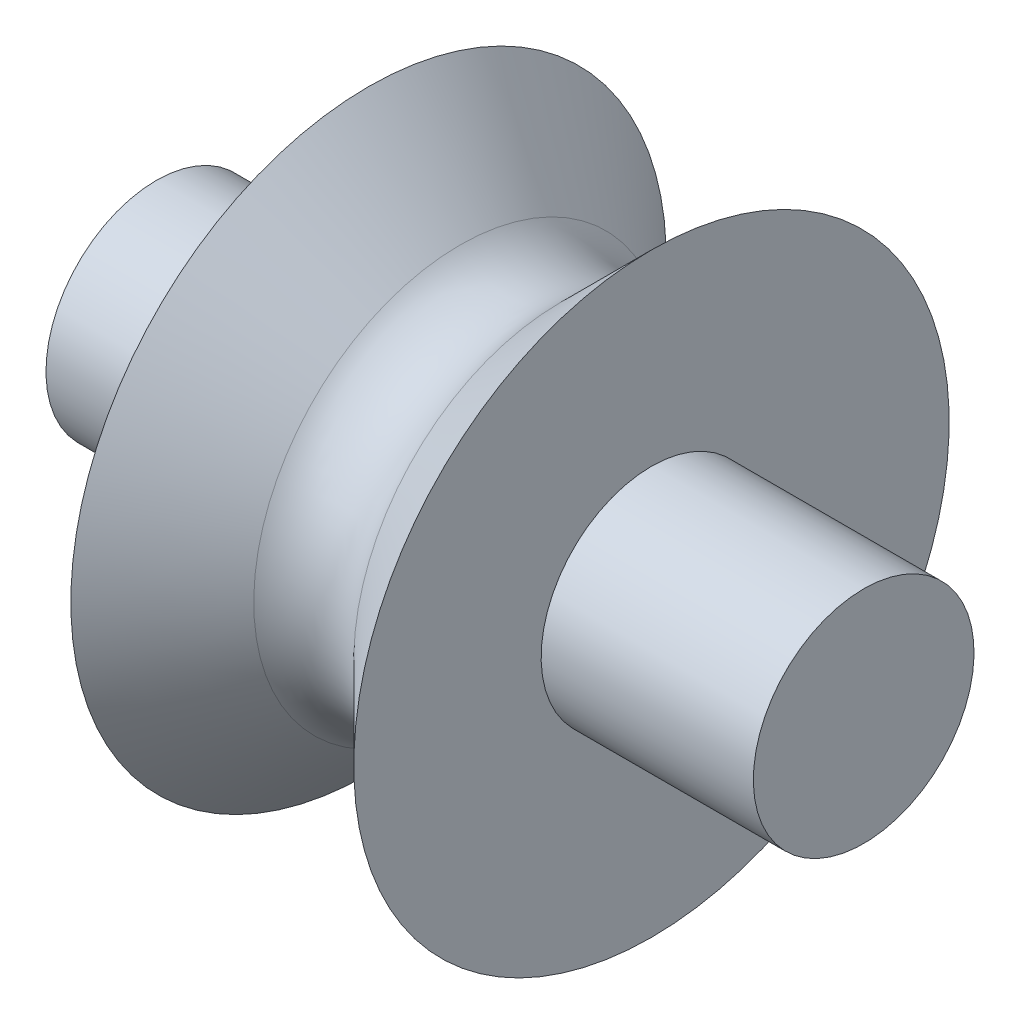
ISO-10303-21;
HEADER;
FILE_DESCRIPTION(('STEP AP214'),'2;1');
FILE_NAME('part.step','',(''),(''),'','','');
FILE_SCHEMA(('AUTOMOTIVE_DESIGN { 1 0 10303 214 1 1 1 1 }'));
ENDSEC;
DATA;
#1=APPLICATION_CONTEXT('core data for automotive mechanical design processes');
#2=APPLICATION_PROTOCOL_DEFINITION('international standard','automotive_design',2000,#1);
#3=PRODUCT_CONTEXT('',#1,'mechanical');
#4=PRODUCT('Part','Part','',(#3));
#5=PRODUCT_RELATED_PRODUCT_CATEGORY('part','',(#4));
#6=PRODUCT_DEFINITION_FORMATION('','',#4);
#7=PRODUCT_DEFINITION_CONTEXT('part definition',#1,'design');
#8=PRODUCT_DEFINITION('design','',#6,#7);
#9=PRODUCT_DEFINITION_SHAPE('','',#8);
#10=(LENGTH_UNIT() NAMED_UNIT(*) SI_UNIT(.MILLI.,.METRE.));
#11=(NAMED_UNIT(*) PLANE_ANGLE_UNIT() SI_UNIT($,.RADIAN.));
#12=(NAMED_UNIT(*) SI_UNIT($,.STERADIAN.) SOLID_ANGLE_UNIT());
#13=UNCERTAINTY_MEASURE_WITH_UNIT(LENGTH_MEASURE(1.E-05),#10,'distance_accuracy_value','');
#14=(GEOMETRIC_REPRESENTATION_CONTEXT(3) GLOBAL_UNCERTAINTY_ASSIGNED_CONTEXT((#13)) GLOBAL_UNIT_ASSIGNED_CONTEXT((#10,
#11,#12)) REPRESENTATION_CONTEXT('',''));
#15=CARTESIAN_POINT('',(0.,0.,0.));
#16=DIRECTION('',(0.,0.,1.));
#17=DIRECTION('',(1.,0.,0.));
#18=AXIS2_PLACEMENT_3D('',#15,#16,#17);
#19=CARTESIAN_POINT('',(0.,-3.9624,0.));
#20=DIRECTION('',(-1.,0.,0.));
#21=DIRECTION('',(0.,-1.,0.));
#22=AXIS2_PLACEMENT_3D('',#19,#20,#21);
#23=PLANE('',#22);
#24=CARTESIAN_POINT('',(0.,-3.9624,0.));
#25=DIRECTION('',(1.,0.,0.));
#26=DIRECTION('',(0.,1.,0.));
#27=AXIS2_PLACEMENT_3D('',#24,#25,#26);
#28=CIRCLE('',#27,3.9624);
#29=CARTESIAN_POINT('',(0.,0.,0.));
#30=VERTEX_POINT('',#29);
#31=EDGE_CURVE('E10',#30,#30,#28,.T.);
#32=ORIENTED_EDGE('',*,*,#31,.F.);
#33=EDGE_LOOP('',(#32));
#34=FACE_BOUND('',#33,.T.);
#35=ADVANCED_FACE('F37',(#34),#23,.T.);
#36=CARTESIAN_POINT('',(25.4,-3.9624,0.));
#37=DIRECTION('',(1.,0.,0.));
#38=DIRECTION('',(0.,1.,0.));
#39=AXIS2_PLACEMENT_3D('',#36,#37,#38);
#40=CYLINDRICAL_SURFACE('',#39,3.9624);
#41=ORIENTED_EDGE('',*,*,#31,.T.);
#42=EDGE_LOOP('',(#41));
#43=FACE_BOUND('',#42,.T.);
#44=CARTESIAN_POINT('',(7.62,-3.9624,0.));
#45=DIRECTION('',(1.,0.,0.));
#46=DIRECTION('',(0.,1.,0.));
#47=AXIS2_PLACEMENT_3D('',#44,#45,#46);
#48=CIRCLE('',#47,3.9624);
#49=CARTESIAN_POINT('',(7.62,0.,0.));
#50=VERTEX_POINT('',#49);
#51=EDGE_CURVE('E44',#50,#50,#48,.T.);
#52=ORIENTED_EDGE('',*,*,#51,.F.);
#53=EDGE_LOOP('',(#52));
#54=FACE_BOUND('',#53,.T.);
#55=ADVANCED_FACE('F93',(#43,#54),#40,.T.);
#56=CARTESIAN_POINT('',(7.62,0.,0.));
#57=DIRECTION('',(-1.,0.,0.));
#58=DIRECTION('',(0.,-1.,0.));
#59=AXIS2_PLACEMENT_3D('',#56,#57,#58);
#60=PLANE('',#59);
#61=ORIENTED_EDGE('',*,*,#51,.T.);
#62=EDGE_LOOP('',(#61));
#63=FACE_BOUND('',#62,.T.);
#64=CARTESIAN_POINT('',(7.62,-3.9624,0.));
#65=DIRECTION('',(1.,0.,0.));
#66=DIRECTION('',(0.,1.,0.));
#67=AXIS2_PLACEMENT_3D('',#64,#65,#66);
#68=CIRCLE('',#67,10.6892769638459);
#69=CARTESIAN_POINT('',(7.62,6.72687696384587,0.));
#70=VERTEX_POINT('',#69);
#71=EDGE_CURVE('E49',#70,#70,#68,.T.);
#72=ORIENTED_EDGE('',*,*,#71,.F.);
#73=EDGE_LOOP('',(#72));
#74=FACE_BOUND('',#73,.T.);
#75=ADVANCED_FACE('F98',(#63,#74),#60,.T.);
#76=CARTESIAN_POINT('',(10.9039487757862,-3.9624,0.));
#77=DIRECTION('',(-1.,0.,0.));
#78=DIRECTION('',(0.,-1.,0.));
#79=AXIS2_PLACEMENT_3D('',#76,#77,#78);
#80=CONICAL_SURFACE('',#79,7.40532818805969,0.785398163397448);
#81=ORIENTED_EDGE('',*,*,#71,.T.);
#82=EDGE_LOOP('',(#81));
#83=FACE_BOUND('',#82,.T.);
#84=CARTESIAN_POINT('',(10.9039487757862,-3.9624,0.));
#85=DIRECTION('',(1.,0.,0.));
#86=DIRECTION('',(0.,1.,0.));
#87=AXIS2_PLACEMENT_3D('',#84,#85,#86);
#88=CIRCLE('',#87,7.40532818805969);
#89=CARTESIAN_POINT('',(10.9039487757862,3.4429281880597,0.));
#90=VERTEX_POINT('',#89);
#91=EDGE_CURVE('E54',#90,#90,#88,.T.);
#92=ORIENTED_EDGE('',*,*,#91,.F.);
#93=EDGE_LOOP('',(#92));
#94=FACE_BOUND('',#93,.T.);
#95=ADVANCED_FACE('F102',(#83,#94),#80,.T.);
#96=CARTESIAN_POINT('',(12.7,-3.9624,0.));
#97=DIRECTION('',(1.,0.,0.));
#98=DIRECTION('',(0.,1.,0.));
#99=AXIS2_PLACEMENT_3D('',#96,#97,#98);
#100=TOROIDAL_SURFACE('',#99,9.20137941227352,2.54);
#101=ORIENTED_EDGE('',*,*,#91,.T.);
#102=EDGE_LOOP('',(#101));
#103=FACE_BOUND('',#102,.T.);
#104=CARTESIAN_POINT('',(14.4960512242138,-3.9624,0.));
#105=DIRECTION('',(1.,0.,0.));
#106=DIRECTION('',(0.,1.,0.));
#107=AXIS2_PLACEMENT_3D('',#104,#105,#106);
#108=CIRCLE('',#107,7.4053281880597);
#109=CARTESIAN_POINT('',(14.4960512242138,3.4429281880597,0.));
#110=VERTEX_POINT('',#109);
#111=EDGE_CURVE('E60',#110,#110,#108,.T.);
#112=ORIENTED_EDGE('',*,*,#111,.F.);
#113=EDGE_LOOP('',(#112));
#114=FACE_BOUND('',#113,.T.);
#115=ADVANCED_FACE('F108',(#103,#114),#100,.F.);
#116=CARTESIAN_POINT('',(17.78,-3.9624,0.));
#117=DIRECTION('',(1.,0.,0.));
#118=DIRECTION('',(0.,1.,0.));
#119=AXIS2_PLACEMENT_3D('',#116,#117,#118);
#120=CONICAL_SURFACE('',#119,10.6892769638459,0.785398163397449);
#121=ORIENTED_EDGE('',*,*,#111,.T.);
#122=EDGE_LOOP('',(#121));
#123=FACE_BOUND('',#122,.T.);
#124=CARTESIAN_POINT('',(17.78,-3.9624,0.));
#125=DIRECTION('',(1.,0.,0.));
#126=DIRECTION('',(0.,1.,0.));
#127=AXIS2_PLACEMENT_3D('',#124,#125,#126);
#128=CIRCLE('',#127,10.6892769638459);
#129=CARTESIAN_POINT('',(17.78,6.72687696384587,0.));
#130=VERTEX_POINT('',#129);
#131=EDGE_CURVE('E64',#130,#130,#128,.T.);
#132=ORIENTED_EDGE('',*,*,#131,.F.);
#133=EDGE_LOOP('',(#132));
#134=FACE_BOUND('',#133,.T.);
#135=ADVANCED_FACE('F89',(#123,#134),#120,.T.);
#136=CARTESIAN_POINT('',(17.78,6.72687696384587,0.));
#137=DIRECTION('',(1.,0.,0.));
#138=DIRECTION('',(0.,1.,0.));
#139=AXIS2_PLACEMENT_3D('',#136,#137,#138);
#140=PLANE('',#139);
#141=ORIENTED_EDGE('',*,*,#131,.T.);
#142=EDGE_LOOP('',(#141));
#143=FACE_BOUND('',#142,.T.);
#144=CARTESIAN_POINT('',(17.78,-3.9624,0.));
#145=DIRECTION('',(1.,0.,0.));
#146=DIRECTION('',(0.,1.,0.));
#147=AXIS2_PLACEMENT_3D('',#144,#145,#146);
#148=CIRCLE('',#147,3.9624);
#149=CARTESIAN_POINT('',(17.78,0.,0.));
#150=VERTEX_POINT('',#149);
#151=EDGE_CURVE('E68',#150,#150,#148,.T.);
#152=ORIENTED_EDGE('',*,*,#151,.F.);
#153=EDGE_LOOP('',(#152));
#154=FACE_BOUND('',#153,.T.);
#155=ADVANCED_FACE('F81',(#143,#154),#140,.T.);
#156=CARTESIAN_POINT('',(25.4,-3.9624,0.));
#157=DIRECTION('',(1.,0.,0.));
#158=DIRECTION('',(0.,1.,0.));
#159=AXIS2_PLACEMENT_3D('',#156,#157,#158);
#160=CYLINDRICAL_SURFACE('',#159,3.9624);
#161=ORIENTED_EDGE('',*,*,#151,.T.);
#162=EDGE_LOOP('',(#161));
#163=FACE_BOUND('',#162,.T.);
#164=CARTESIAN_POINT('',(25.4,-3.9624,0.));
#165=DIRECTION('',(1.,0.,0.));
#166=DIRECTION('',(0.,1.,0.));
#167=AXIS2_PLACEMENT_3D('',#164,#165,#166);
#168=CIRCLE('',#167,3.9624);
#169=CARTESIAN_POINT('',(25.4,0.,0.));
#170=VERTEX_POINT('',#169);
#171=EDGE_CURVE('E72',#170,#170,#168,.T.);
#172=ORIENTED_EDGE('',*,*,#171,.F.);
#173=EDGE_LOOP('',(#172));
#174=FACE_BOUND('',#173,.T.);
#175=ADVANCED_FACE('F79',(#163,#174),#160,.T.);
#176=CARTESIAN_POINT('',(25.4,0.,0.));
#177=DIRECTION('',(1.,0.,0.));
#178=DIRECTION('',(0.,1.,0.));
#179=AXIS2_PLACEMENT_3D('',#176,#177,#178);
#180=PLANE('',#179);
#181=ORIENTED_EDGE('',*,*,#171,.T.);
#182=EDGE_LOOP('',(#181));
#183=FACE_BOUND('',#182,.T.);
#184=ADVANCED_FACE('F77',(#183),#180,.T.);
#185=CLOSED_SHELL('',(#35,#55,#75,#95,#115,#135,#155,#175,#184));
#186=MANIFOLD_SOLID_BREP('B2',#185);
#187=ADVANCED_BREP_SHAPE_REPRESENTATION('',(#18,#186),#14);
#188=SHAPE_DEFINITION_REPRESENTATION(#9,#187);
ENDSEC;
END-ISO-10303-21;
